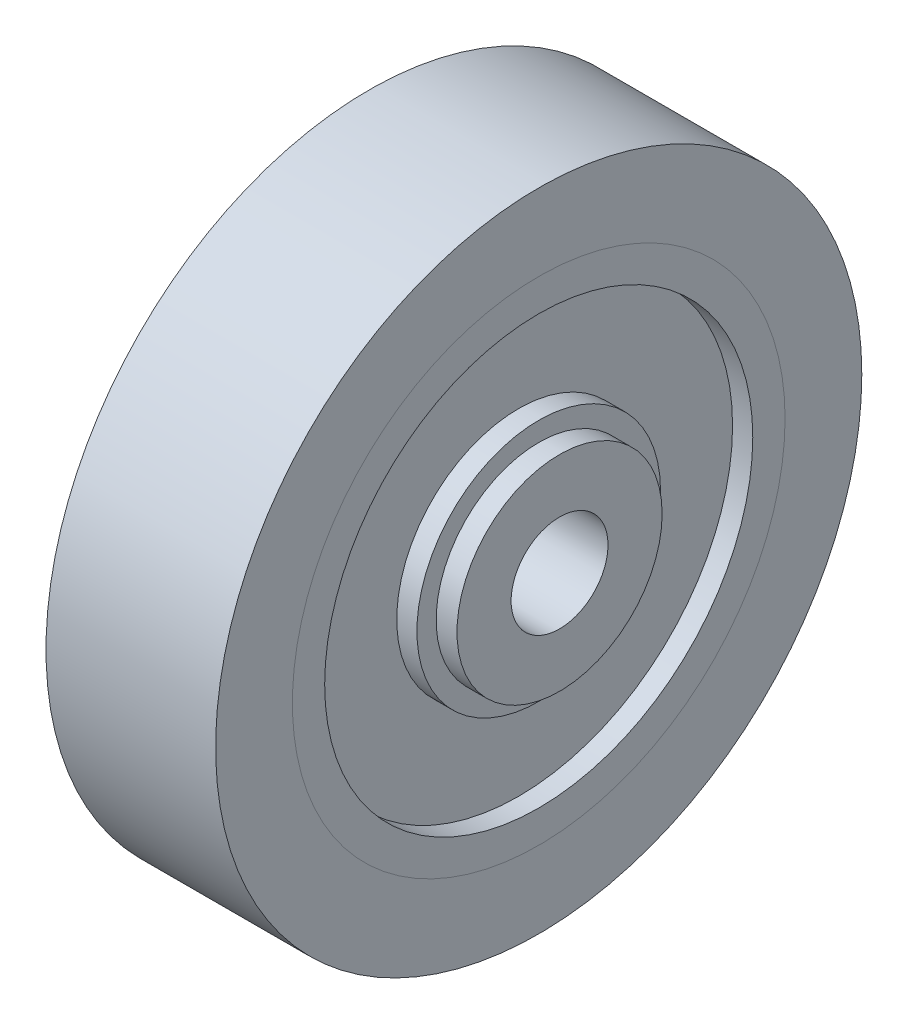
ISO-10303-21;
HEADER;
FILE_DESCRIPTION(('STEP AP214'),'2;1');
FILE_NAME('part.step','',(''),(''),'','','');
FILE_SCHEMA(('AUTOMOTIVE_DESIGN { 1 0 10303 214 1 1 1 1 }'));
ENDSEC;
DATA;
#1=APPLICATION_CONTEXT('core data for automotive mechanical design processes');
#2=APPLICATION_PROTOCOL_DEFINITION('international standard','automotive_design',2000,#1);
#3=PRODUCT_CONTEXT('',#1,'mechanical');
#4=PRODUCT('Part','Part','',(#3));
#5=PRODUCT_RELATED_PRODUCT_CATEGORY('part','',(#4));
#6=PRODUCT_DEFINITION_FORMATION('','',#4);
#7=PRODUCT_DEFINITION_CONTEXT('part definition',#1,'design');
#8=PRODUCT_DEFINITION('design','',#6,#7);
#9=PRODUCT_DEFINITION_SHAPE('','',#8);
#10=(LENGTH_UNIT() NAMED_UNIT(*) SI_UNIT(.MILLI.,.METRE.));
#11=(NAMED_UNIT(*) PLANE_ANGLE_UNIT() SI_UNIT($,.RADIAN.));
#12=(NAMED_UNIT(*) SI_UNIT($,.STERADIAN.) SOLID_ANGLE_UNIT());
#13=UNCERTAINTY_MEASURE_WITH_UNIT(LENGTH_MEASURE(1.E-05),#10,'distance_accuracy_value','');
#14=(GEOMETRIC_REPRESENTATION_CONTEXT(3) GLOBAL_UNCERTAINTY_ASSIGNED_CONTEXT((#13)) GLOBAL_UNIT_ASSIGNED_CONTEXT((#10,
#11,#12)) REPRESENTATION_CONTEXT('',''));
#15=CARTESIAN_POINT('',(0.,0.,0.));
#16=DIRECTION('',(0.,0.,1.));
#17=DIRECTION('',(1.,0.,0.));
#18=AXIS2_PLACEMENT_3D('',#15,#16,#17);
#19=CARTESIAN_POINT('',(31.8263405205863,0.,0.));
#20=DIRECTION('',(-1.,0.,0.));
#21=DIRECTION('',(0.,0.,1.));
#22=AXIS2_PLACEMENT_3D('',#19,#20,#21);
#23=CYLINDRICAL_SURFACE('',#22,7.54);
#24=CARTESIAN_POINT('',(9.25,0.,0.));
#25=DIRECTION('',(1.,0.,0.));
#26=DIRECTION('',(0.,0.,-1.));
#27=AXIS2_PLACEMENT_3D('',#24,#25,#26);
#28=CIRCLE('',#27,7.54);
#29=CARTESIAN_POINT('',(9.25,0.,-7.54));
#30=VERTEX_POINT('',#29);
#31=EDGE_CURVE('E53',#30,#30,#28,.T.);
#32=ORIENTED_EDGE('',*,*,#31,.T.);
#33=EDGE_LOOP('',(#32));
#34=FACE_BOUND('',#33,.T.);
#35=CARTESIAN_POINT('',(10.5,0.,0.));
#36=DIRECTION('',(1.,0.,0.));
#37=DIRECTION('',(0.,0.,-1.));
#38=AXIS2_PLACEMENT_3D('',#35,#36,#37);
#39=CIRCLE('',#38,7.54);
#40=CARTESIAN_POINT('',(10.5,0.,-7.54));
#41=VERTEX_POINT('',#40);
#42=EDGE_CURVE('E11',#41,#41,#39,.T.);
#43=ORIENTED_EDGE('',*,*,#42,.F.);
#44=EDGE_LOOP('',(#43));
#45=FACE_BOUND('',#44,.T.);
#46=ADVANCED_FACE('F46',(#34,#45),#23,.T.);
#47=CARTESIAN_POINT('',(9.25,0.,0.));
#48=DIRECTION('',(1.,0.,0.));
#49=DIRECTION('',(0.,0.,-1.));
#50=AXIS2_PLACEMENT_3D('',#47,#48,#49);
#51=PLANE('',#50);
#52=ORIENTED_EDGE('',*,*,#31,.F.);
#53=EDGE_LOOP('',(#52));
#54=FACE_BOUND('',#53,.T.);
#55=CARTESIAN_POINT('',(9.25,0.,0.));
#56=DIRECTION('',(1.,0.,0.));
#57=DIRECTION('',(0.,0.,-1.));
#58=AXIS2_PLACEMENT_3D('',#55,#56,#57);
#59=CIRCLE('',#58,5.94);
#60=CARTESIAN_POINT('',(9.25,0.,-5.94));
#61=VERTEX_POINT('',#60);
#62=EDGE_CURVE('E58',#61,#61,#59,.T.);
#63=ORIENTED_EDGE('',*,*,#62,.T.);
#64=EDGE_LOOP('',(#63));
#65=FACE_BOUND('',#64,.T.);
#66=ADVANCED_FACE('F74',(#54,#65),#51,.F.);
#67=CARTESIAN_POINT('',(31.8263405205863,0.,0.));
#68=DIRECTION('',(-1.,0.,0.));
#69=DIRECTION('',(0.,0.,1.));
#70=AXIS2_PLACEMENT_3D('',#67,#68,#69);
#71=CYLINDRICAL_SURFACE('',#70,5.94);
#72=ORIENTED_EDGE('',*,*,#62,.F.);
#73=EDGE_LOOP('',(#72));
#74=FACE_BOUND('',#73,.T.);
#75=CARTESIAN_POINT('',(10.5,0.,0.));
#76=DIRECTION('',(1.,0.,0.));
#77=DIRECTION('',(0.,0.,-1.));
#78=AXIS2_PLACEMENT_3D('',#75,#76,#77);
#79=CIRCLE('',#78,5.94);
#80=CARTESIAN_POINT('',(10.5,0.,-5.94));
#81=VERTEX_POINT('',#80);
#82=EDGE_CURVE('E49',#81,#81,#79,.T.);
#83=ORIENTED_EDGE('',*,*,#82,.T.);
#84=EDGE_LOOP('',(#83));
#85=FACE_BOUND('',#84,.T.);
#86=ADVANCED_FACE('F66',(#74,#85),#71,.F.);
#87=CARTESIAN_POINT('',(10.5,0.,0.));
#88=DIRECTION('',(1.,0.,0.));
#89=DIRECTION('',(0.,0.,-1.));
#90=AXIS2_PLACEMENT_3D('',#87,#88,#89);
#91=PLANE('',#90);
#92=ORIENTED_EDGE('',*,*,#82,.F.);
#93=EDGE_LOOP('',(#92));
#94=FACE_BOUND('',#93,.T.);
#95=ORIENTED_EDGE('',*,*,#42,.T.);
#96=EDGE_LOOP('',(#95));
#97=FACE_BOUND('',#96,.T.);
#98=ADVANCED_FACE('F68',(#94,#97),#91,.T.);
#99=CLOSED_SHELL('',(#46,#66,#86,#98));
#100=MANIFOLD_SOLID_BREP('B2',#99);
#101=CARTESIAN_POINT('',(9.25,0.,0.));
#102=DIRECTION('',(1.,0.,0.));
#103=DIRECTION('',(0.,0.,-1.));
#104=AXIS2_PLACEMENT_3D('',#101,#102,#103);
#105=PLANE('',#104);
#106=DIRECTION('',(0.,-0.866025403784439,0.5));
#107=VECTOR('',#106,1.);
#108=CARTESIAN_POINT('',(9.25,0.,7.33234841870825));
#109=LINE('',#108,#107);
#110=CARTESIAN_POINT('',(9.25,6.35,3.66617420935412));
#111=VERTEX_POINT('',#110);
#112=CARTESIAN_POINT('',(9.25,0.,7.33234841870825));
#113=VERTEX_POINT('',#112);
#114=EDGE_CURVE('E174',#111,#113,#109,.T.);
#115=ORIENTED_EDGE('',*,*,#114,.T.);
#116=DIRECTION('',(0.,-0.866025403784439,-0.5));
#117=VECTOR('',#116,1.);
#118=CARTESIAN_POINT('',(9.25,-6.35,3.66617420935412));
#119=LINE('',#118,#117);
#120=CARTESIAN_POINT('',(9.25,-6.35,3.66617420935412));
#121=VERTEX_POINT('',#120);
#122=EDGE_CURVE('E182',#113,#121,#119,.T.);
#123=ORIENTED_EDGE('',*,*,#122,.T.);
#124=DIRECTION('',(0.,0.,-1.));
#125=VECTOR('',#124,1.);
#126=CARTESIAN_POINT('',(9.25,-6.35,-3.66617420935413));
#127=LINE('',#126,#125);
#128=CARTESIAN_POINT('',(9.25,-6.35,-3.66617420935413));
#129=VERTEX_POINT('',#128);
#130=EDGE_CURVE('E189',#121,#129,#127,.T.);
#131=ORIENTED_EDGE('',*,*,#130,.T.);
#132=DIRECTION('',(0.,0.866025403784439,-0.5));
#133=VECTOR('',#132,1.);
#134=CARTESIAN_POINT('',(9.25,0.,-7.33234841870825));
#135=LINE('',#134,#133);
#136=CARTESIAN_POINT('',(9.25,0.,-7.33234841870825));
#137=VERTEX_POINT('',#136);
#138=EDGE_CURVE('E204',#129,#137,#135,.T.);
#139=ORIENTED_EDGE('',*,*,#138,.T.);
#140=DIRECTION('',(0.,0.866025403784439,0.5));
#141=VECTOR('',#140,1.);
#142=CARTESIAN_POINT('',(9.25,6.35,-3.66617420935412));
#143=LINE('',#142,#141);
#144=CARTESIAN_POINT('',(9.25,6.35,-3.66617420935412));
#145=VERTEX_POINT('',#144);
#146=EDGE_CURVE('E196',#137,#145,#143,.T.);
#147=ORIENTED_EDGE('',*,*,#146,.T.);
#148=DIRECTION('',(0.,0.,1.));
#149=VECTOR('',#148,1.);
#150=CARTESIAN_POINT('',(9.25,6.35,3.66617420935412));
#151=LINE('',#150,#149);
#152=EDGE_CURVE('E193',#145,#111,#151,.T.);
#153=ORIENTED_EDGE('',*,*,#152,.T.);
#154=EDGE_LOOP('',(#115,#123,#131,#139,#147,#153));
#155=FACE_BOUND('',#154,.T.);
#156=CARTESIAN_POINT('',(9.25,0.,0.));
#157=DIRECTION('',(1.,0.,0.));
#158=DIRECTION('',(0.,0.,-1.));
#159=AXIS2_PLACEMENT_3D('',#156,#157,#158);
#160=CIRCLE('',#159,5.94);
#161=CARTESIAN_POINT('',(9.25,0.,-5.94));
#162=VERTEX_POINT('',#161);
#163=EDGE_CURVE('E199',#162,#162,#160,.T.);
#164=ORIENTED_EDGE('',*,*,#163,.F.);
#165=EDGE_LOOP('',(#164));
#166=FACE_BOUND('',#165,.T.);
#167=ADVANCED_FACE('F118',(#155,#166),#105,.T.);
#168=CARTESIAN_POINT('',(1.25,0.,0.));
#169=DIRECTION('',(-1.,0.,0.));
#170=DIRECTION('',(0.,0.,1.));
#171=AXIS2_PLACEMENT_3D('',#168,#169,#170);
#172=PLANE('',#171);
#173=CARTESIAN_POINT('',(1.25,0.,0.));
#174=DIRECTION('',(-1.,0.,0.));
#175=DIRECTION('',(0.,0.,1.));
#176=AXIS2_PLACEMENT_3D('',#173,#174,#175);
#177=CIRCLE('',#176,7.625);
#178=CARTESIAN_POINT('',(1.25,0.,7.625));
#179=VERTEX_POINT('',#178);
#180=EDGE_CURVE('E126',#179,#179,#177,.T.);
#181=ORIENTED_EDGE('',*,*,#180,.F.);
#182=EDGE_LOOP('',(#181));
#183=FACE_BOUND('',#182,.T.);
#184=DIRECTION('',(0.,-0.866025403784439,0.5));
#185=VECTOR('',#184,1.);
#186=CARTESIAN_POINT('',(1.25,0.,7.33234841870825));
#187=LINE('',#186,#185);
#188=CARTESIAN_POINT('',(1.25,6.35,3.66617420935412));
#189=VERTEX_POINT('',#188);
#190=CARTESIAN_POINT('',(1.25,0.,7.33234841870825));
#191=VERTEX_POINT('',#190);
#192=EDGE_CURVE('E133',#189,#191,#187,.T.);
#193=ORIENTED_EDGE('',*,*,#192,.F.);
#194=DIRECTION('',(0.,0.,1.));
#195=VECTOR('',#194,1.);
#196=CARTESIAN_POINT('',(1.25,6.35,3.66617420935412));
#197=LINE('',#196,#195);
#198=CARTESIAN_POINT('',(1.25,6.35,-3.66617420935412));
#199=VERTEX_POINT('',#198);
#200=EDGE_CURVE('E138',#199,#189,#197,.T.);
#201=ORIENTED_EDGE('',*,*,#200,.F.);
#202=DIRECTION('',(0.,0.866025403784438,0.5));
#203=VECTOR('',#202,1.);
#204=CARTESIAN_POINT('',(1.25,6.35,-3.66617420935412));
#205=LINE('',#204,#203);
#206=CARTESIAN_POINT('',(1.25,0.,-7.33234841870825));
#207=VERTEX_POINT('',#206);
#208=EDGE_CURVE('E215',#207,#199,#205,.T.);
#209=ORIENTED_EDGE('',*,*,#208,.F.);
#210=DIRECTION('',(0.,0.866025403784439,-0.5));
#211=VECTOR('',#210,1.);
#212=CARTESIAN_POINT('',(1.25,0.,-7.33234841870825));
#213=LINE('',#212,#211);
#214=CARTESIAN_POINT('',(1.25,-6.35,-3.66617420935413));
#215=VERTEX_POINT('',#214);
#216=EDGE_CURVE('E212',#215,#207,#213,.T.);
#217=ORIENTED_EDGE('',*,*,#216,.F.);
#218=DIRECTION('',(0.,0.,-1.));
#219=VECTOR('',#218,1.);
#220=CARTESIAN_POINT('',(1.25,-6.35,-3.66617420935413));
#221=LINE('',#220,#219);
#222=CARTESIAN_POINT('',(1.25,-6.35,3.66617420935412));
#223=VERTEX_POINT('',#222);
#224=EDGE_CURVE('E209',#223,#215,#221,.T.);
#225=ORIENTED_EDGE('',*,*,#224,.F.);
#226=DIRECTION('',(0.,-0.866025403784439,-0.5));
#227=VECTOR('',#226,1.);
#228=CARTESIAN_POINT('',(1.25,-6.35,3.66617420935412));
#229=LINE('',#228,#227);
#230=EDGE_CURVE('E188',#191,#223,#229,.T.);
#231=ORIENTED_EDGE('',*,*,#230,.F.);
#232=EDGE_LOOP('',(#193,#201,#209,#217,#225,#231));
#233=FACE_BOUND('',#232,.T.);
#234=ADVANCED_FACE('F249',(#183,#233),#172,.F.);
#235=CARTESIAN_POINT('',(-21.5667568261897,0.,0.));
#236=DIRECTION('',(1.,0.,0.));
#237=DIRECTION('',(0.,0.,-1.));
#238=AXIS2_PLACEMENT_3D('',#235,#236,#237);
#239=CYLINDRICAL_SURFACE('',#238,7.625);
#240=CARTESIAN_POINT('',(0.,0.,0.));
#241=DIRECTION('',(1.,0.,0.));
#242=DIRECTION('',(0.,0.,-1.));
#243=AXIS2_PLACEMENT_3D('',#240,#241,#242);
#244=CIRCLE('',#243,7.625);
#245=CARTESIAN_POINT('',(0.,0.,-7.625));
#246=VERTEX_POINT('',#245);
#247=EDGE_CURVE('E230',#246,#246,#244,.T.);
#248=ORIENTED_EDGE('',*,*,#247,.T.);
#249=EDGE_LOOP('',(#248));
#250=FACE_BOUND('',#249,.T.);
#251=ORIENTED_EDGE('',*,*,#180,.T.);
#252=EDGE_LOOP('',(#251));
#253=FACE_BOUND('',#252,.T.);
#254=ADVANCED_FACE('F235',(#250,#253),#239,.T.);
#255=CARTESIAN_POINT('',(-21.5667568261897,0.,0.));
#256=DIRECTION('',(1.,0.,0.));
#257=DIRECTION('',(0.,0.,-1.));
#258=AXIS2_PLACEMENT_3D('',#255,#256,#257);
#259=CYLINDRICAL_SURFACE('',#258,3.);
#260=CARTESIAN_POINT('',(5.25,2.59807621135332,1.5));
#261=CARTESIAN_POINT('',(5.17183828770713,2.59808302092689,1.4999945446118));
#262=CARTESIAN_POINT('',(5.09357788271243,2.60165701781635,1.49384995609983));
#263=CARTESIAN_POINT('',(4.93945910298427,2.61543549678079,1.46958481484708));
#264=CARTESIAN_POINT('',(4.86360612743489,2.62565391083339,1.45143909683127));
#265=CARTESIAN_POINT('',(4.71682250348409,2.65124019908098,1.40414992304972));
#266=CARTESIAN_POINT('',(4.64586802128962,2.66658065209878,1.3750649287406));
#267=CARTESIAN_POINT('',(4.50986369700492,2.70063997225287,1.30690128806456));
#268=CARTESIAN_POINT('',(4.44481417460632,2.71935902214097,1.26782210105366));
#269=CARTESIAN_POINT('',(4.31654140716374,2.75995303586162,1.17699981079632));
#270=CARTESIAN_POINT('',(4.25391129648969,2.7819609545693,1.12447805421566));
#271=CARTESIAN_POINT('',(4.13788741738994,2.82557974178559,1.0098807114217));
#272=CARTESIAN_POINT('',(4.08449825612472,2.84719040746875,0.947800388673439));
#273=CARTESIAN_POINT('',(3.98494927327851,2.88932215429424,0.810734345121819));
#274=CARTESIAN_POINT('',(3.93951934821071,2.90967159627259,0.735160783518863));
#275=CARTESIAN_POINT('',(3.86228872013136,2.94526134149293,0.576235539899257));
#276=CARTESIAN_POINT('',(3.83047941579425,2.96050486775612,0.492888807207234));
#277=CARTESIAN_POINT('',(3.78374300804836,2.98320691866356,0.327067415888967));
#278=CARTESIAN_POINT('',(3.7677757104667,2.99114220331338,0.244952685733227));
#279=CARTESIAN_POINT('',(3.74975082198744,3.00011375769101,0.0788559430467733));
#280=CARTESIAN_POINT('',(3.74768481480644,3.00115420176885,-0.00512490876560674));
#281=CARTESIAN_POINT('',(3.75712001095553,2.99644472874675,-0.164748786635624));
#282=CARTESIAN_POINT('',(3.76745702328184,2.99127743838241,-0.240481798765186));
#283=CARTESIAN_POINT('',(3.79932126585699,2.97561367889621,-0.388970657877482));
#284=CARTESIAN_POINT('',(3.82084933346434,2.96511681099591,-0.461726281640887));
#285=CARTESIAN_POINT('',(3.87462384913472,2.93957374931482,-0.603464087354329));
#286=CARTESIAN_POINT('',(3.9070144697581,2.92446662293799,-0.672380135272767));
#287=CARTESIAN_POINT('',(3.98139512430224,2.89106468980031,-0.803965202269992));
#288=CARTESIAN_POINT('',(4.02338859495353,2.87276874236226,-0.866631973257968));
#289=CARTESIAN_POINT('',(4.12034302729952,2.83266591598844,-0.990260491347291));
#290=CARTESIAN_POINT('',(4.17615454248902,2.81069063997263,-1.05050111254404));
#291=CARTESIAN_POINT('',(4.29688458739527,2.76681510880218,-1.16115655544667));
#292=CARTESIAN_POINT('',(4.36181005841109,2.74491492398443,-1.21156381736134));
#293=CARTESIAN_POINT('',(4.50397228863613,2.70216234138727,-1.30425800196332));
#294=CARTESIAN_POINT('',(4.58172903458132,2.68146479986061,-1.34582597246708));
#295=CARTESIAN_POINT('',(4.7444065070385,2.64563175417864,-1.41497866950185));
#296=CARTESIAN_POINT('',(4.82931964952634,2.63049045069101,-1.44257798731633));
#297=CARTESIAN_POINT('',(4.99682176692419,2.60916953725552,-1.48077031653756));
#298=CARTESIAN_POINT('',(5.07906167856533,2.60237483772745,-1.49253768317996));
#299=CARTESIAN_POINT('',(5.24460201227481,2.59676879042414,-1.50227541991714));
#300=CARTESIAN_POINT('',(5.32790164367968,2.59795180333967,-1.50025553597254));
#301=CARTESIAN_POINT('',(5.48348087786809,2.60751504810877,-1.48355406501595));
#302=CARTESIAN_POINT('',(5.55596917666189,2.61509381259981,-1.4702817250687));
#303=CARTESIAN_POINT('',(5.69755167940644,2.63541032327012,-1.43354442694866));
#304=CARTESIAN_POINT('',(5.76664477611991,2.64814974007551,-1.41007616793542));
#305=CARTESIAN_POINT('',(5.90311699635405,2.67804333119485,-1.35247138290733));
#306=CARTESIAN_POINT('',(5.97026852528033,2.69537464864595,-1.31789109553908));
#307=CARTESIAN_POINT('',(6.09820390730849,2.73234179245875,-1.23943059602371));
#308=CARTESIAN_POINT('',(6.15898446526993,2.75197880032721,-1.19554560649832));
#309=CARTESIAN_POINT('',(6.28046815128532,2.79431997684504,-1.09325575079828));
#310=CARTESIAN_POINT('',(6.34019572607649,2.81709874731434,-1.03371790847245));
#311=CARTESIAN_POINT('',(6.44911835699039,2.86101352466839,-0.905106743097433));
#312=CARTESIAN_POINT('',(6.49830985534581,2.88214897511564,-0.83603021198302));
#313=CARTESIAN_POINT('',(6.58586058892515,2.92112042536435,-0.687803043838135));
#314=CARTESIAN_POINT('',(6.62389967731637,2.93885462508044,-0.608434646361169));
#315=CARTESIAN_POINT('',(6.68570685578609,2.96825032438951,-0.443283546961623));
#316=CARTESIAN_POINT('',(6.70948747704946,2.9799171551456,-0.357506552088263));
#317=CARTESIAN_POINT('',(6.74005284626199,2.99501262272824,-0.190469523495625));
#318=CARTESIAN_POINT('',(6.74819681381417,2.99909891862287,-0.109517165775685));
#319=CARTESIAN_POINT('',(6.7512648981816,3.00063195562697,0.0526889789268058));
#320=CARTESIAN_POINT('',(6.74619364278535,2.99808102100335,0.133942650442631));
#321=CARTESIAN_POINT('',(6.72387538980656,2.98700953256884,0.288806988475721));
#322=CARTESIAN_POINT('',(6.70745272611349,2.97889342001985,0.362568476716896));
#323=CARTESIAN_POINT('',(6.66400950104554,2.95788140495135,0.506168928275427));
#324=CARTESIAN_POINT('',(6.63698741985982,2.94498481699193,0.576007327433264));
#325=CARTESIAN_POINT('',(6.57190942175104,2.9148889612218,0.713135109367327));
#326=CARTESIAN_POINT('',(6.53343101518824,2.89752925798199,0.78018771405007));
#327=CARTESIAN_POINT('',(6.44706310371143,2.86032199712739,0.907161962721038));
#328=CARTESIAN_POINT('',(6.39916927632649,2.84047329837541,0.967080311122361));
#329=CARTESIAN_POINT('',(6.28980429146595,2.79792915339941,1.08437100623534));
#330=CARTESIAN_POINT('',(6.22745626878421,2.77514698517547,1.14089652680891));
#331=CARTESIAN_POINT('',(6.09382391830535,2.73094614244278,1.24299493109201));
#332=CARTESIAN_POINT('',(6.02253176869847,2.70952868642798,1.28855812501509));
#333=CARTESIAN_POINT('',(5.87004503012857,2.66999407957374,1.36864661967848));
#334=CARTESIAN_POINT('',(5.7886087033069,2.65200261384405,1.40277759894141));
#335=CARTESIAN_POINT('',(5.62000139349033,2.62299234492527,1.45631806425962));
#336=CARTESIAN_POINT('',(5.53285066663097,2.61195024221553,1.47577678676302));
#337=CARTESIAN_POINT('',(5.41229196652201,2.60293908902686,1.49155051179662));
#338=CARTESIAN_POINT('',(5.37994815840318,2.60112193507728,1.49471415744578));
#339=CARTESIAN_POINT('',(5.31507527897664,2.59868903831625,1.49894010763494));
#340=CARTESIAN_POINT('',(5.28254619542119,2.59807337587664,1.50000227159981));
#341=CARTESIAN_POINT('',(5.25,2.59807621135332,1.5));
#342=B_SPLINE_CURVE_WITH_KNOTS('',3,(#260,#261,#262,#263,#264,#265,#266,#267,#268,#269,#270,
#271,#272,#273,#274,#275,#276,#277,#278,#279,#280,#281,#282,#283,#284,#285,#286,#287,#288,#289,
#290,#291,#292,#293,#294,#295,#296,#297,#298,#299,#300,#301,#302,#303,#304,#305,#306,#307,#308,
#309,#310,#311,#312,#313,#314,#315,#316,#317,#318,#319,#320,#321,#322,#323,#324,#325,#326,#327,
#328,#329,#330,#331,#332,#333,#334,#335,#336,#337,#338,#339,#340,#341),.UNSPECIFIED.,.T.,.F.,(4,
2,2,2,2,2,2,2,2,2,2,2,2,2,2,2,2,2,2,2,2,2,2,2,2,2,2,2,2,2,2,2,2,2,2,2,2,2,2,2,4),(0.,
0.234348183892073,0.469189339237207,0.702792893878328,0.936409088167725,1.18929346874735,
1.44230356626556,1.71236838358145,1.98226240445836,2.23295227451903,2.4834903552906,
2.71224146226807,2.94100968776183,3.1729430209672,3.40495949025408,3.65890787185336,
3.91305072368878,4.18333262594172,4.45333161317557,4.70193436281318,4.95036139782559,
5.17161275136038,5.39293578654094,5.62450944609131,5.85620229330071,6.1171011537092,
6.37808797467303,6.64596272119448,6.91360169713157,7.1566840558423,7.39968130190957,
7.62666637307239,7.85368400268019,8.09041126079208,8.32724745151078,8.58765362775101,
8.84828914267731,9.11716123557907,9.3851269950414,9.48270202777963,9.5802835874181),.UNSPECIFIED.);
#343=CARTESIAN_POINT('',(5.25,2.59807621135332,1.5));
#344=VERTEX_POINT('',#343);
#345=EDGE_CURVE('E280',#344,#344,#342,.T.);
#346=ORIENTED_EDGE('',*,*,#345,.F.);
#347=EDGE_LOOP('',(#346));
#348=FACE_BOUND('',#347,.T.);
#349=CARTESIAN_POINT('',(0.,0.,0.));
#350=DIRECTION('',(1.,0.,0.));
#351=DIRECTION('',(0.,0.,-1.));
#352=AXIS2_PLACEMENT_3D('',#349,#350,#351);
#353=CIRCLE('',#352,3.);
#354=CARTESIAN_POINT('',(0.,0.,-3.));
#355=VERTEX_POINT('',#354);
#356=EDGE_CURVE('E44',#355,#355,#353,.T.);
#357=ORIENTED_EDGE('',*,*,#356,.F.);
#358=EDGE_LOOP('',(#357));
#359=FACE_BOUND('',#358,.T.);
#360=CARTESIAN_POINT('',(11.79,0.,0.));
#361=DIRECTION('',(1.,0.,0.));
#362=DIRECTION('',(0.,0.,-1.));
#363=AXIS2_PLACEMENT_3D('',#360,#361,#362);
#364=CIRCLE('',#363,3.);
#365=CARTESIAN_POINT('',(11.79,0.,-3.));
#366=VERTEX_POINT('',#365);
#367=EDGE_CURVE('E288',#366,#366,#364,.T.);
#368=ORIENTED_EDGE('',*,*,#367,.T.);
#369=EDGE_LOOP('',(#368));
#370=FACE_BOUND('',#369,.T.);
#371=ADVANCED_FACE('F239',(#348,#359,#370),#259,.F.);
#372=CARTESIAN_POINT('',(0.,0.,0.));
#373=DIRECTION('',(1.,0.,0.));
#374=DIRECTION('',(0.,0.,-1.));
#375=AXIS2_PLACEMENT_3D('',#372,#373,#374);
#376=PLANE('',#375);
#377=ORIENTED_EDGE('',*,*,#356,.T.);
#378=EDGE_LOOP('',(#377));
#379=FACE_BOUND('',#378,.T.);
#380=ORIENTED_EDGE('',*,*,#247,.F.);
#381=EDGE_LOOP('',(#380));
#382=FACE_BOUND('',#381,.T.);
#383=ADVANCED_FACE('F120',(#379,#382),#376,.F.);
#384=CARTESIAN_POINT('',(28.6495704419797,0.,7.33234841870825));
#385=DIRECTION('',(0.,-0.5,-0.866025403784439));
#386=DIRECTION('',(0.,0.866025403784439,-0.5));
#387=AXIS2_PLACEMENT_3D('',#384,#385,#386);
#388=PLANE('',#387);
#389=ORIENTED_EDGE('',*,*,#114,.F.);
#390=DIRECTION('',(-1.,0.,0.));
#391=VECTOR('',#390,1.);
#392=CARTESIAN_POINT('',(28.6495704419797,6.35,3.66617420935412));
#393=LINE('',#392,#391);
#394=EDGE_CURVE('E178',#111,#189,#393,.T.);
#395=ORIENTED_EDGE('',*,*,#394,.T.);
#396=ORIENTED_EDGE('',*,*,#192,.T.);
#397=DIRECTION('',(-1.,0.,0.));
#398=VECTOR('',#397,1.);
#399=CARTESIAN_POINT('',(28.6495704419797,0.,7.33234841870825));
#400=LINE('',#399,#398);
#401=EDGE_CURVE('E170',#113,#191,#400,.T.);
#402=ORIENTED_EDGE('',*,*,#401,.F.);
#403=EDGE_LOOP('',(#389,#395,#396,#402));
#404=FACE_BOUND('',#403,.T.);
#405=ADVANCED_FACE('F172',(#404),#388,.F.);
#406=CARTESIAN_POINT('',(28.6495704419797,6.35,3.66617420935412));
#407=DIRECTION('',(0.,-1.,0.));
#408=DIRECTION('',(0.,0.,-1.));
#409=AXIS2_PLACEMENT_3D('',#406,#407,#408);
#410=PLANE('',#409);
#411=CARTESIAN_POINT('',(5.25,6.35,0.));
#412=DIRECTION('',(0.,1.,0.));
#413=DIRECTION('',(0.,0.,1.));
#414=AXIS2_PLACEMENT_3D('',#411,#412,#413);
#415=CIRCLE('',#414,1.5);
#416=CARTESIAN_POINT('',(5.25,6.35,1.5));
#417=VERTEX_POINT('',#416);
#418=EDGE_CURVE('E289',#417,#417,#415,.T.);
#419=ORIENTED_EDGE('',*,*,#418,.F.);
#420=EDGE_LOOP('',(#419));
#421=FACE_BOUND('',#420,.T.);
#422=ORIENTED_EDGE('',*,*,#152,.F.);
#423=DIRECTION('',(-1.,0.,0.));
#424=VECTOR('',#423,1.);
#425=CARTESIAN_POINT('',(28.6495704419797,6.35,-3.66617420935412));
#426=LINE('',#425,#424);
#427=EDGE_CURVE('E221',#145,#199,#426,.T.);
#428=ORIENTED_EDGE('',*,*,#427,.T.);
#429=ORIENTED_EDGE('',*,*,#200,.T.);
#430=ORIENTED_EDGE('',*,*,#394,.F.);
#431=EDGE_LOOP('',(#422,#428,#429,#430));
#432=FACE_BOUND('',#431,.T.);
#433=ADVANCED_FACE('F245',(#421,#432),#410,.F.);
#434=CARTESIAN_POINT('',(28.6495704419797,6.35,-3.66617420935412));
#435=DIRECTION('',(0.,-0.5,0.866025403784438));
#436=DIRECTION('',(0.,-0.866025403784439,-0.5));
#437=AXIS2_PLACEMENT_3D('',#434,#435,#436);
#438=PLANE('',#437);
#439=ORIENTED_EDGE('',*,*,#146,.F.);
#440=DIRECTION('',(-1.,0.,0.));
#441=VECTOR('',#440,1.);
#442=CARTESIAN_POINT('',(28.6495704419797,0.,-7.33234841870825));
#443=LINE('',#442,#441);
#444=EDGE_CURVE('E223',#137,#207,#443,.T.);
#445=ORIENTED_EDGE('',*,*,#444,.T.);
#446=ORIENTED_EDGE('',*,*,#208,.T.);
#447=ORIENTED_EDGE('',*,*,#427,.F.);
#448=EDGE_LOOP('',(#439,#445,#446,#447));
#449=FACE_BOUND('',#448,.T.);
#450=ADVANCED_FACE('F262',(#449),#438,.F.);
#451=CARTESIAN_POINT('',(28.6495704419797,0.,-7.33234841870825));
#452=DIRECTION('',(0.,0.5,0.866025403784439));
#453=DIRECTION('',(0.,-0.866025403784439,0.5));
#454=AXIS2_PLACEMENT_3D('',#451,#452,#453);
#455=PLANE('',#454);
#456=ORIENTED_EDGE('',*,*,#138,.F.);
#457=DIRECTION('',(-1.,0.,0.));
#458=VECTOR('',#457,1.);
#459=CARTESIAN_POINT('',(28.6495704419797,-6.35,-3.66617420935413));
#460=LINE('',#459,#458);
#461=EDGE_CURVE('E226',#129,#215,#460,.T.);
#462=ORIENTED_EDGE('',*,*,#461,.T.);
#463=ORIENTED_EDGE('',*,*,#216,.T.);
#464=ORIENTED_EDGE('',*,*,#444,.F.);
#465=EDGE_LOOP('',(#456,#462,#463,#464));
#466=FACE_BOUND('',#465,.T.);
#467=ADVANCED_FACE('F266',(#466),#455,.F.);
#468=CARTESIAN_POINT('',(28.6495704419797,-6.35,-3.66617420935413));
#469=DIRECTION('',(0.,1.,0.));
#470=DIRECTION('',(0.,0.,1.));
#471=AXIS2_PLACEMENT_3D('',#468,#469,#470);
#472=PLANE('',#471);
#473=ORIENTED_EDGE('',*,*,#130,.F.);
#474=DIRECTION('',(-1.,0.,0.));
#475=VECTOR('',#474,1.);
#476=CARTESIAN_POINT('',(28.6495704419797,-6.35,3.66617420935412));
#477=LINE('',#476,#475);
#478=EDGE_CURVE('E185',#121,#223,#477,.T.);
#479=ORIENTED_EDGE('',*,*,#478,.T.);
#480=ORIENTED_EDGE('',*,*,#224,.T.);
#481=ORIENTED_EDGE('',*,*,#461,.F.);
#482=EDGE_LOOP('',(#473,#479,#480,#481));
#483=FACE_BOUND('',#482,.T.);
#484=ADVANCED_FACE('F270',(#483),#472,.F.);
#485=CARTESIAN_POINT('',(28.6495704419797,-6.35,3.66617420935412));
#486=DIRECTION('',(0.,0.5,-0.866025403784439));
#487=DIRECTION('',(0.,0.866025403784439,0.5));
#488=AXIS2_PLACEMENT_3D('',#485,#486,#487);
#489=PLANE('',#488);
#490=ORIENTED_EDGE('',*,*,#122,.F.);
#491=ORIENTED_EDGE('',*,*,#401,.T.);
#492=ORIENTED_EDGE('',*,*,#230,.T.);
#493=ORIENTED_EDGE('',*,*,#478,.F.);
#494=EDGE_LOOP('',(#490,#491,#492,#493));
#495=FACE_BOUND('',#494,.T.);
#496=ADVANCED_FACE('F183',(#495),#489,.F.);
#497=CARTESIAN_POINT('',(27.3008571209924,0.,0.));
#498=DIRECTION('',(-1.,0.,0.));
#499=DIRECTION('',(0.,0.,1.));
#500=AXIS2_PLACEMENT_3D('',#497,#498,#499);
#501=CYLINDRICAL_SURFACE('',#500,5.94);
#502=ORIENTED_EDGE('',*,*,#163,.T.);
#503=EDGE_LOOP('',(#502));
#504=FACE_BOUND('',#503,.T.);
#505=CARTESIAN_POINT('',(10.5,0.,0.));
#506=DIRECTION('',(1.,0.,0.));
#507=DIRECTION('',(0.,0.,-1.));
#508=AXIS2_PLACEMENT_3D('',#505,#506,#507);
#509=CIRCLE('',#508,5.94);
#510=CARTESIAN_POINT('',(10.5,0.,-5.94));
#511=VERTEX_POINT('',#510);
#512=EDGE_CURVE('E194',#511,#511,#509,.T.);
#513=ORIENTED_EDGE('',*,*,#512,.F.);
#514=EDGE_LOOP('',(#513));
#515=FACE_BOUND('',#514,.T.);
#516=ADVANCED_FACE('F257',(#504,#515),#501,.T.);
#517=CARTESIAN_POINT('',(11.79,0.,0.));
#518=DIRECTION('',(1.,0.,0.));
#519=DIRECTION('',(0.,0.,-1.));
#520=AXIS2_PLACEMENT_3D('',#517,#518,#519);
#521=PLANE('',#520);
#522=CARTESIAN_POINT('',(11.79,0.,0.));
#523=DIRECTION('',(1.,0.,0.));
#524=DIRECTION('',(0.,0.,-1.));
#525=AXIS2_PLACEMENT_3D('',#522,#523,#524);
#526=CIRCLE('',#525,6.35);
#527=CARTESIAN_POINT('',(11.79,0.,-6.35));
#528=VERTEX_POINT('',#527);
#529=EDGE_CURVE('E311',#528,#528,#526,.T.);
#530=ORIENTED_EDGE('',*,*,#529,.T.);
#531=EDGE_LOOP('',(#530));
#532=FACE_BOUND('',#531,.T.);
#533=ORIENTED_EDGE('',*,*,#367,.F.);
#534=EDGE_LOOP('',(#533));
#535=FACE_BOUND('',#534,.T.);
#536=ADVANCED_FACE('F297',(#532,#535),#521,.T.);
#537=CARTESIAN_POINT('',(10.5,0.,0.));
#538=DIRECTION('',(1.,0.,0.));
#539=DIRECTION('',(0.,0.,-1.));
#540=AXIS2_PLACEMENT_3D('',#537,#538,#539);
#541=PLANE('',#540);
#542=ORIENTED_EDGE('',*,*,#512,.T.);
#543=EDGE_LOOP('',(#542));
#544=FACE_BOUND('',#543,.T.);
#545=CARTESIAN_POINT('',(10.5,0.,0.));
#546=DIRECTION('',(1.,0.,0.));
#547=DIRECTION('',(0.,0.,-1.));
#548=AXIS2_PLACEMENT_3D('',#545,#546,#547);
#549=CIRCLE('',#548,6.35);
#550=CARTESIAN_POINT('',(10.5,0.,-6.35));
#551=VERTEX_POINT('',#550);
#552=EDGE_CURVE('E314',#551,#551,#549,.T.);
#553=ORIENTED_EDGE('',*,*,#552,.F.);
#554=EDGE_LOOP('',(#553));
#555=FACE_BOUND('',#554,.T.);
#556=ADVANCED_FACE('F300',(#544,#555),#541,.F.);
#557=CARTESIAN_POINT('',(11.79,0.,0.));
#558=DIRECTION('',(-1.,0.,0.));
#559=DIRECTION('',(0.,0.,1.));
#560=AXIS2_PLACEMENT_3D('',#557,#558,#559);
#561=CYLINDRICAL_SURFACE('',#560,6.35);
#562=ORIENTED_EDGE('',*,*,#529,.F.);
#563=EDGE_LOOP('',(#562));
#564=FACE_BOUND('',#563,.T.);
#565=ORIENTED_EDGE('',*,*,#552,.T.);
#566=EDGE_LOOP('',(#565));
#567=FACE_BOUND('',#566,.T.);
#568=ADVANCED_FACE('F295',(#564,#567),#561,.T.);
#569=CARTESIAN_POINT('',(5.25,-4.24264068711928,0.));
#570=DIRECTION('',(0.,1.,0.));
#571=DIRECTION('',(0.,0.,1.));
#572=AXIS2_PLACEMENT_3D('',#569,#570,#571);
#573=CYLINDRICAL_SURFACE('',#572,1.5);
#574=ORIENTED_EDGE('',*,*,#345,.T.);
#575=EDGE_LOOP('',(#574));
#576=FACE_BOUND('',#575,.T.);
#577=ORIENTED_EDGE('',*,*,#418,.T.);
#578=EDGE_LOOP('',(#577));
#579=FACE_BOUND('',#578,.T.);
#580=ADVANCED_FACE('F291',(#576,#579),#573,.F.);
#581=CLOSED_SHELL('',(#167,#234,#254,#371,#383,#405,#433,#450,#467,#484,#496,#516,#536,#556,
#568,#580));
#582=MANIFOLD_SOLID_BREP('B6',#581);
#583=CARTESIAN_POINT('',(-43.1335136523794,0.,0.));
#584=DIRECTION('',(1.,0.,0.));
#585=DIRECTION('',(0.,0.,-1.));
#586=AXIS2_PLACEMENT_3D('',#583,#584,#585);
#587=CYLINDRICAL_SURFACE('',#586,13.25);
#588=CARTESIAN_POINT('',(0.,0.,0.));
#589=DIRECTION('',(1.,0.,0.));
#590=DIRECTION('',(0.,0.,-1.));
#591=AXIS2_PLACEMENT_3D('',#588,#589,#590);
#592=CIRCLE('',#591,13.25);
#593=CARTESIAN_POINT('',(0.,0.,-13.25));
#594=VERTEX_POINT('',#593);
#595=EDGE_CURVE('E455',#594,#594,#592,.F.);
#596=ORIENTED_EDGE('',*,*,#595,.T.);
#597=EDGE_LOOP('',(#596));
#598=FACE_BOUND('',#597,.T.);
#599=CARTESIAN_POINT('',(1.25,0.,0.));
#600=DIRECTION('',(1.,0.,0.));
#601=DIRECTION('',(0.,0.,-1.));
#602=AXIS2_PLACEMENT_3D('',#599,#600,#601);
#603=CIRCLE('',#602,13.25);
#604=CARTESIAN_POINT('',(1.25,0.,-13.25));
#605=VERTEX_POINT('',#604);
#606=EDGE_CURVE('E116',#605,#605,#603,.F.);
#607=ORIENTED_EDGE('',*,*,#606,.F.);
#608=EDGE_LOOP('',(#607));
#609=FACE_BOUND('',#608,.T.);
#610=ADVANCED_FACE('F447',(#598,#609),#587,.F.);
#611=CARTESIAN_POINT('',(-43.1335136523794,0.,0.));
#612=DIRECTION('',(1.,0.,0.));
#613=DIRECTION('',(0.,0.,-1.));
#614=AXIS2_PLACEMENT_3D('',#611,#612,#613);
#615=CYLINDRICAL_SURFACE('',#614,15.25);
#616=CARTESIAN_POINT('',(0.,0.,0.));
#617=DIRECTION('',(1.,0.,0.));
#618=DIRECTION('',(0.,0.,-1.));
#619=AXIS2_PLACEMENT_3D('',#616,#617,#618);
#620=CIRCLE('',#619,15.25);
#621=CARTESIAN_POINT('',(0.,0.,-15.25));
#622=VERTEX_POINT('',#621);
#623=EDGE_CURVE('E550',#622,#622,#620,.F.);
#624=ORIENTED_EDGE('',*,*,#623,.F.);
#625=EDGE_LOOP('',(#624));
#626=FACE_BOUND('',#625,.T.);
#627=CARTESIAN_POINT('',(10.5,0.,0.));
#628=DIRECTION('',(1.,0.,0.));
#629=DIRECTION('',(0.,0.,-1.));
#630=AXIS2_PLACEMENT_3D('',#627,#628,#629);
#631=CIRCLE('',#630,15.25);
#632=CARTESIAN_POINT('',(10.5,0.,-15.25));
#633=VERTEX_POINT('',#632);
#634=EDGE_CURVE('E553',#633,#633,#631,.T.);
#635=ORIENTED_EDGE('',*,*,#634,.F.);
#636=EDGE_LOOP('',(#635));
#637=FACE_BOUND('',#636,.T.);
#638=ADVANCED_FACE('F449',(#626,#637),#615,.T.);
#639=CARTESIAN_POINT('',(10.5,0.,0.));
#640=DIRECTION('',(1.,0.,0.));
#641=DIRECTION('',(0.,0.,-1.));
#642=AXIS2_PLACEMENT_3D('',#639,#640,#641);
#643=PLANE('',#642);
#644=CARTESIAN_POINT('',(10.5,0.,0.));
#645=DIRECTION('',(1.,0.,0.));
#646=DIRECTION('',(0.,0.,-1.));
#647=AXIS2_PLACEMENT_3D('',#644,#645,#646);
#648=CIRCLE('',#647,13.25);
#649=CARTESIAN_POINT('',(10.5,0.,-13.25));
#650=VERTEX_POINT('',#649);
#651=EDGE_CURVE('E539',#650,#650,#648,.T.);
#652=ORIENTED_EDGE('',*,*,#651,.F.);
#653=EDGE_LOOP('',(#652));
#654=FACE_BOUND('',#653,.T.);
#655=ORIENTED_EDGE('',*,*,#634,.T.);
#656=EDGE_LOOP('',(#655));
#657=FACE_BOUND('',#656,.T.);
#658=ADVANCED_FACE('F575',(#654,#657),#643,.T.);
#659=CARTESIAN_POINT('',(9.25,0.,0.));
#660=DIRECTION('',(1.,0.,0.));
#661=DIRECTION('',(0.,0.,-1.));
#662=AXIS2_PLACEMENT_3D('',#659,#660,#661);
#663=CIRCLE('',#662,13.25);
#664=CARTESIAN_POINT('',(9.25,0.,-13.25));
#665=VERTEX_POINT('',#664);
#666=EDGE_CURVE('E536',#665,#665,#663,.T.);
#667=ORIENTED_EDGE('',*,*,#666,.F.);
#668=EDGE_LOOP('',(#667));
#669=FACE_BOUND('',#668,.T.);
#670=ORIENTED_EDGE('',*,*,#651,.T.);
#671=EDGE_LOOP('',(#670));
#672=FACE_BOUND('',#671,.T.);
#673=ADVANCED_FACE('F565',(#669,#672),#587,.F.);
#674=CARTESIAN_POINT('',(0.,0.,0.));
#675=DIRECTION('',(1.,0.,0.));
#676=DIRECTION('',(0.,0.,-1.));
#677=AXIS2_PLACEMENT_3D('',#674,#675,#676);
#678=PLANE('',#677);
#679=ORIENTED_EDGE('',*,*,#623,.T.);
#680=EDGE_LOOP('',(#679));
#681=FACE_BOUND('',#680,.T.);
#682=ORIENTED_EDGE('',*,*,#595,.F.);
#683=EDGE_LOOP('',(#682));
#684=FACE_BOUND('',#683,.T.);
#685=ADVANCED_FACE('F562',(#681,#684),#678,.F.);
#686=CARTESIAN_POINT('',(47.976659402887,-6.35,3.66617420935412));
#687=DIRECTION('',(0.,1.,0.));
#688=DIRECTION('',(0.,0.,1.));
#689=AXIS2_PLACEMENT_3D('',#686,#687,#688);
#690=PLANE('',#689);
#691=DIRECTION('',(-1.,0.,0.));
#692=VECTOR('',#691,1.);
#693=CARTESIAN_POINT('',(47.976659402887,-6.35,3.66617420935412));
#694=LINE('',#693,#692);
#695=CARTESIAN_POINT('',(9.25,-6.35,3.66617420935412));
#696=VERTEX_POINT('',#695);
#697=CARTESIAN_POINT('',(1.25,-6.35,3.66617420935412));
#698=VERTEX_POINT('',#697);
#699=EDGE_CURVE('E541',#696,#698,#694,.T.);
#700=ORIENTED_EDGE('',*,*,#699,.F.);
#701=DIRECTION('',(0.,0.,-1.));
#702=VECTOR('',#701,1.);
#703=CARTESIAN_POINT('',(9.25,-6.35,3.66617420935412));
#704=LINE('',#703,#702);
#705=CARTESIAN_POINT('',(9.25,-6.35,-3.66617420935412));
#706=VERTEX_POINT('',#705);
#707=EDGE_CURVE('E504',#696,#706,#704,.T.);
#708=ORIENTED_EDGE('',*,*,#707,.T.);
#709=DIRECTION('',(-1.,0.,0.));
#710=VECTOR('',#709,1.);
#711=CARTESIAN_POINT('',(47.976659402887,-6.35,-3.66617420935412));
#712=LINE('',#711,#710);
#713=CARTESIAN_POINT('',(1.25,-6.35,-3.66617420935413));
#714=VERTEX_POINT('',#713);
#715=EDGE_CURVE('E535',#706,#714,#712,.T.);
#716=ORIENTED_EDGE('',*,*,#715,.T.);
#717=DIRECTION('',(0.,0.,1.));
#718=VECTOR('',#717,1.);
#719=CARTESIAN_POINT('',(1.25,-6.35,3.66617420935412));
#720=LINE('',#719,#718);
#721=EDGE_CURVE('E516',#714,#698,#720,.T.);
#722=ORIENTED_EDGE('',*,*,#721,.T.);
#723=EDGE_LOOP('',(#700,#708,#716,#722));
#724=FACE_BOUND('',#723,.T.);
#725=ADVANCED_FACE('F564',(#724),#690,.T.);
#726=CARTESIAN_POINT('',(47.976659402887,0.,7.33234841870825));
#727=DIRECTION('',(0.,0.5,-0.866025403784439));
#728=DIRECTION('',(0.,0.866025403784439,0.5));
#729=AXIS2_PLACEMENT_3D('',#726,#727,#728);
#730=PLANE('',#729);
#731=DIRECTION('',(-1.,0.,0.));
#732=VECTOR('',#731,1.);
#733=CARTESIAN_POINT('',(47.976659402887,0.,7.33234841870825));
#734=LINE('',#733,#732);
#735=CARTESIAN_POINT('',(9.25,0.,7.33234841870825));
#736=VERTEX_POINT('',#735);
#737=CARTESIAN_POINT('',(1.25,0.,7.33234841870825));
#738=VERTEX_POINT('',#737);
#739=EDGE_CURVE('E543',#736,#738,#734,.T.);
#740=ORIENTED_EDGE('',*,*,#739,.F.);
#741=DIRECTION('',(0.,-0.866025403784439,-0.5));
#742=VECTOR('',#741,1.);
#743=CARTESIAN_POINT('',(9.25,0.,7.33234841870825));
#744=LINE('',#743,#742);
#745=EDGE_CURVE('E523',#736,#696,#744,.T.);
#746=ORIENTED_EDGE('',*,*,#745,.T.);
#747=ORIENTED_EDGE('',*,*,#699,.T.);
#748=DIRECTION('',(0.,0.866025403784439,0.5));
#749=VECTOR('',#748,1.);
#750=CARTESIAN_POINT('',(1.25,0.,7.33234841870825));
#751=LINE('',#750,#749);
#752=EDGE_CURVE('E682',#698,#738,#751,.T.);
#753=ORIENTED_EDGE('',*,*,#752,.T.);
#754=EDGE_LOOP('',(#740,#746,#747,#753));
#755=FACE_BOUND('',#754,.T.);
#756=ADVANCED_FACE('F572',(#755),#730,.T.);
#757=CARTESIAN_POINT('',(47.976659402887,6.35,3.66617420935412));
#758=DIRECTION('',(0.,-0.5,-0.866025403784439));
#759=DIRECTION('',(0.,0.866025403784439,-0.5));
#760=AXIS2_PLACEMENT_3D('',#757,#758,#759);
#761=PLANE('',#760);
#762=DIRECTION('',(-1.,0.,0.));
#763=VECTOR('',#762,1.);
#764=CARTESIAN_POINT('',(47.976659402887,6.35,3.66617420935412));
#765=LINE('',#764,#763);
#766=CARTESIAN_POINT('',(9.25,6.35,3.66617420935412));
#767=VERTEX_POINT('',#766);
#768=CARTESIAN_POINT('',(1.25,6.35,3.66617420935412));
#769=VERTEX_POINT('',#768);
#770=EDGE_CURVE('E545',#767,#769,#765,.T.);
#771=ORIENTED_EDGE('',*,*,#770,.F.);
#772=DIRECTION('',(0.,-0.866025403784439,0.5));
#773=VECTOR('',#772,1.);
#774=CARTESIAN_POINT('',(9.25,6.35,3.66617420935412));
#775=LINE('',#774,#773);
#776=EDGE_CURVE('E526',#767,#736,#775,.T.);
#777=ORIENTED_EDGE('',*,*,#776,.T.);
#778=ORIENTED_EDGE('',*,*,#739,.T.);
#779=DIRECTION('',(0.,0.866025403784439,-0.5));
#780=VECTOR('',#779,1.);
#781=CARTESIAN_POINT('',(1.25,6.35,3.66617420935412));
#782=LINE('',#781,#780);
#783=EDGE_CURVE('E680',#738,#769,#782,.T.);
#784=ORIENTED_EDGE('',*,*,#783,.T.);
#785=EDGE_LOOP('',(#771,#777,#778,#784));
#786=FACE_BOUND('',#785,.T.);
#787=ADVANCED_FACE('F617',(#786),#761,.T.);
#788=CARTESIAN_POINT('',(47.976659402887,6.35,-3.66617420935412));
#789=DIRECTION('',(0.,-1.,0.));
#790=DIRECTION('',(0.,0.,-1.));
#791=AXIS2_PLACEMENT_3D('',#788,#789,#790);
#792=PLANE('',#791);
#793=DIRECTION('',(-1.,0.,0.));
#794=VECTOR('',#793,1.);
#795=CARTESIAN_POINT('',(47.976659402887,6.35,-3.66617420935412));
#796=LINE('',#795,#794);
#797=CARTESIAN_POINT('',(9.25,6.35,-3.66617420935412));
#798=VERTEX_POINT('',#797);
#799=CARTESIAN_POINT('',(1.25,6.35,-3.66617420935412));
#800=VERTEX_POINT('',#799);
#801=EDGE_CURVE('E505',#798,#800,#796,.T.);
#802=ORIENTED_EDGE('',*,*,#801,.F.);
#803=DIRECTION('',(0.,0.,1.));
#804=VECTOR('',#803,1.);
#805=CARTESIAN_POINT('',(9.25,6.35,-3.66617420935412));
#806=LINE('',#805,#804);
#807=EDGE_CURVE('E530',#798,#767,#806,.T.);
#808=ORIENTED_EDGE('',*,*,#807,.T.);
#809=ORIENTED_EDGE('',*,*,#770,.T.);
#810=DIRECTION('',(0.,0.,-1.));
#811=VECTOR('',#810,1.);
#812=CARTESIAN_POINT('',(1.25,6.35,-3.66617420935412));
#813=LINE('',#812,#811);
#814=EDGE_CURVE('E527',#769,#800,#813,.T.);
#815=ORIENTED_EDGE('',*,*,#814,.T.);
#816=EDGE_LOOP('',(#802,#808,#809,#815));
#817=FACE_BOUND('',#816,.T.);
#818=ADVANCED_FACE('F627',(#817),#792,.T.);
#819=CARTESIAN_POINT('',(47.976659402887,0.,-7.33234841870825));
#820=DIRECTION('',(0.,-0.5,0.866025403784438));
#821=DIRECTION('',(0.,-0.866025403784438,-0.5));
#822=AXIS2_PLACEMENT_3D('',#819,#820,#821);
#823=PLANE('',#822);
#824=DIRECTION('',(-1.,0.,0.));
#825=VECTOR('',#824,1.);
#826=CARTESIAN_POINT('',(47.976659402887,0.,-7.33234841870825));
#827=LINE('',#826,#825);
#828=CARTESIAN_POINT('',(9.25,0.,-7.33234841870825));
#829=VERTEX_POINT('',#828);
#830=CARTESIAN_POINT('',(1.25,0.,-7.33234841870825));
#831=VERTEX_POINT('',#830);
#832=EDGE_CURVE('E498',#829,#831,#827,.T.);
#833=ORIENTED_EDGE('',*,*,#832,.F.);
#834=DIRECTION('',(0.,0.866025403784438,0.5));
#835=VECTOR('',#834,1.);
#836=CARTESIAN_POINT('',(9.25,0.,-7.33234841870825));
#837=LINE('',#836,#835);
#838=EDGE_CURVE('E467',#829,#798,#837,.T.);
#839=ORIENTED_EDGE('',*,*,#838,.T.);
#840=ORIENTED_EDGE('',*,*,#801,.T.);
#841=DIRECTION('',(0.,-0.866025403784438,-0.5));
#842=VECTOR('',#841,1.);
#843=CARTESIAN_POINT('',(1.25,0.,-7.33234841870825));
#844=LINE('',#843,#842);
#845=EDGE_CURVE('E512',#800,#831,#844,.T.);
#846=ORIENTED_EDGE('',*,*,#845,.T.);
#847=EDGE_LOOP('',(#833,#839,#840,#846));
#848=FACE_BOUND('',#847,.T.);
#849=ADVANCED_FACE('F518',(#848),#823,.T.);
#850=CARTESIAN_POINT('',(47.976659402887,-6.35,-3.66617420935412));
#851=DIRECTION('',(0.,0.5,0.866025403784439));
#852=DIRECTION('',(0.,-0.866025403784439,0.5));
#853=AXIS2_PLACEMENT_3D('',#850,#851,#852);
#854=PLANE('',#853);
#855=ORIENTED_EDGE('',*,*,#715,.F.);
#856=DIRECTION('',(0.,0.866025403784439,-0.5));
#857=VECTOR('',#856,1.);
#858=CARTESIAN_POINT('',(9.25,-6.35,-3.66617420935412));
#859=LINE('',#858,#857);
#860=EDGE_CURVE('E462',#706,#829,#859,.T.);
#861=ORIENTED_EDGE('',*,*,#860,.T.);
#862=ORIENTED_EDGE('',*,*,#832,.T.);
#863=DIRECTION('',(0.,-0.866025403784439,0.5));
#864=VECTOR('',#863,1.);
#865=CARTESIAN_POINT('',(1.25,-6.35,-3.66617420935412));
#866=LINE('',#865,#864);
#867=EDGE_CURVE('E501',#831,#714,#866,.T.);
#868=ORIENTED_EDGE('',*,*,#867,.T.);
#869=EDGE_LOOP('',(#855,#861,#862,#868));
#870=FACE_BOUND('',#869,.T.);
#871=ADVANCED_FACE('F500',(#870),#854,.T.);
#872=CARTESIAN_POINT('',(9.25,0.,0.));
#873=DIRECTION('',(1.,0.,0.));
#874=DIRECTION('',(0.,0.,-1.));
#875=AXIS2_PLACEMENT_3D('',#872,#873,#874);
#876=PLANE('',#875);
#877=ORIENTED_EDGE('',*,*,#860,.F.);
#878=ORIENTED_EDGE('',*,*,#707,.F.);
#879=ORIENTED_EDGE('',*,*,#745,.F.);
#880=ORIENTED_EDGE('',*,*,#776,.F.);
#881=ORIENTED_EDGE('',*,*,#807,.F.);
#882=ORIENTED_EDGE('',*,*,#838,.F.);
#883=EDGE_LOOP('',(#877,#878,#879,#880,#881,#882));
#884=FACE_BOUND('',#883,.T.);
#885=ORIENTED_EDGE('',*,*,#666,.T.);
#886=EDGE_LOOP('',(#885));
#887=FACE_BOUND('',#886,.T.);
#888=ADVANCED_FACE('F654',(#884,#887),#876,.T.);
#889=CARTESIAN_POINT('',(1.25,0.,0.));
#890=DIRECTION('',(1.,0.,0.));
#891=DIRECTION('',(0.,0.,-1.));
#892=AXIS2_PLACEMENT_3D('',#889,#890,#891);
#893=PLANE('',#892);
#894=ORIENTED_EDGE('',*,*,#606,.T.);
#895=EDGE_LOOP('',(#894));
#896=FACE_BOUND('',#895,.T.);
#897=ORIENTED_EDGE('',*,*,#845,.F.);
#898=ORIENTED_EDGE('',*,*,#814,.F.);
#899=ORIENTED_EDGE('',*,*,#783,.F.);
#900=ORIENTED_EDGE('',*,*,#752,.F.);
#901=ORIENTED_EDGE('',*,*,#721,.F.);
#902=ORIENTED_EDGE('',*,*,#867,.F.);
#903=EDGE_LOOP('',(#897,#898,#899,#900,#901,#902));
#904=FACE_BOUND('',#903,.T.);
#905=ADVANCED_FACE('F510',(#896,#904),#893,.F.);
#906=CLOSED_SHELL('',(#610,#638,#658,#673,#685,#725,#756,#787,#818,#849,#871,#888,#905));
#907=MANIFOLD_SOLID_BREP('B38',#906);
#908=CARTESIAN_POINT('',(10.5,0.,0.));
#909=DIRECTION('',(1.,0.,0.));
#910=DIRECTION('',(0.,0.,-1.));
#911=AXIS2_PLACEMENT_3D('',#908,#909,#910);
#912=PLANE('',#911);
#913=CARTESIAN_POINT('',(10.5,0.,0.));
#914=DIRECTION('',(1.,0.,0.));
#915=DIRECTION('',(0.,0.,-1.));
#916=AXIS2_PLACEMENT_3D('',#913,#914,#915);
#917=CIRCLE('',#916,20.);
#918=CARTESIAN_POINT('',(10.5,0.,-20.));
#919=VERTEX_POINT('',#918);
#920=EDGE_CURVE('E446',#919,#919,#917,.T.);
#921=ORIENTED_EDGE('',*,*,#920,.T.);
#922=EDGE_LOOP('',(#921));
#923=FACE_BOUND('',#922,.T.);
#924=CARTESIAN_POINT('',(10.5,0.,0.));
#925=DIRECTION('',(1.,0.,0.));
#926=DIRECTION('',(0.,0.,-1.));
#927=AXIS2_PLACEMENT_3D('',#924,#925,#926);
#928=CIRCLE('',#927,15.25);
#929=CARTESIAN_POINT('',(10.5,0.,-15.25));
#930=VERTEX_POINT('',#929);
#931=EDGE_CURVE('E714',#930,#930,#928,.T.);
#932=ORIENTED_EDGE('',*,*,#931,.F.);
#933=EDGE_LOOP('',(#932));
#934=FACE_BOUND('',#933,.T.);
#935=ADVANCED_FACE('F703',(#923,#934),#912,.T.);
#936=CARTESIAN_POINT('',(0.,0.,0.));
#937=DIRECTION('',(1.,0.,0.));
#938=DIRECTION('',(0.,0.,-1.));
#939=AXIS2_PLACEMENT_3D('',#936,#937,#938);
#940=PLANE('',#939);
#941=CARTESIAN_POINT('',(0.,0.,0.));
#942=DIRECTION('',(1.,0.,0.));
#943=DIRECTION('',(0.,0.,-1.));
#944=AXIS2_PLACEMENT_3D('',#941,#942,#943);
#945=CIRCLE('',#944,20.);
#946=CARTESIAN_POINT('',(0.,0.,-20.));
#947=VERTEX_POINT('',#946);
#948=EDGE_CURVE('E707',#947,#947,#945,.T.);
#949=ORIENTED_EDGE('',*,*,#948,.F.);
#950=EDGE_LOOP('',(#949));
#951=FACE_BOUND('',#950,.T.);
#952=CARTESIAN_POINT('',(0.,0.,0.));
#953=DIRECTION('',(1.,0.,0.));
#954=DIRECTION('',(0.,0.,-1.));
#955=AXIS2_PLACEMENT_3D('',#952,#953,#954);
#956=CIRCLE('',#955,15.25);
#957=CARTESIAN_POINT('',(0.,0.,-15.25));
#958=VERTEX_POINT('',#957);
#959=EDGE_CURVE('E716',#958,#958,#956,.T.);
#960=ORIENTED_EDGE('',*,*,#959,.T.);
#961=EDGE_LOOP('',(#960));
#962=FACE_BOUND('',#961,.T.);
#963=ADVANCED_FACE('F726',(#951,#962),#940,.F.);
#964=CARTESIAN_POINT('',(10.5,0.,0.));
#965=DIRECTION('',(-1.,0.,0.));
#966=DIRECTION('',(0.,0.,1.));
#967=AXIS2_PLACEMENT_3D('',#964,#965,#966);
#968=CYLINDRICAL_SURFACE('',#967,20.);
#969=ORIENTED_EDGE('',*,*,#920,.F.);
#970=EDGE_LOOP('',(#969));
#971=FACE_BOUND('',#970,.T.);
#972=ORIENTED_EDGE('',*,*,#948,.T.);
#973=EDGE_LOOP('',(#972));
#974=FACE_BOUND('',#973,.T.);
#975=ADVANCED_FACE('F705',(#971,#974),#968,.T.);
#976=CARTESIAN_POINT('',(10.5,0.,0.));
#977=DIRECTION('',(-1.,0.,0.));
#978=DIRECTION('',(0.,0.,1.));
#979=AXIS2_PLACEMENT_3D('',#976,#977,#978);
#980=CYLINDRICAL_SURFACE('',#979,15.25);
#981=ORIENTED_EDGE('',*,*,#931,.T.);
#982=EDGE_LOOP('',(#981));
#983=FACE_BOUND('',#982,.T.);
#984=ORIENTED_EDGE('',*,*,#959,.F.);
#985=EDGE_LOOP('',(#984));
#986=FACE_BOUND('',#985,.T.);
#987=ADVANCED_FACE('F722',(#983,#986),#980,.F.);
#988=CLOSED_SHELL('',(#935,#963,#975,#987));
#989=MANIFOLD_SOLID_BREP('B110',#988);
#990=ADVANCED_BREP_SHAPE_REPRESENTATION('',(#18,#100,#582,#907,#989),#14);
#991=SHAPE_DEFINITION_REPRESENTATION(#9,#990);
ENDSEC;
END-ISO-10303-21;
